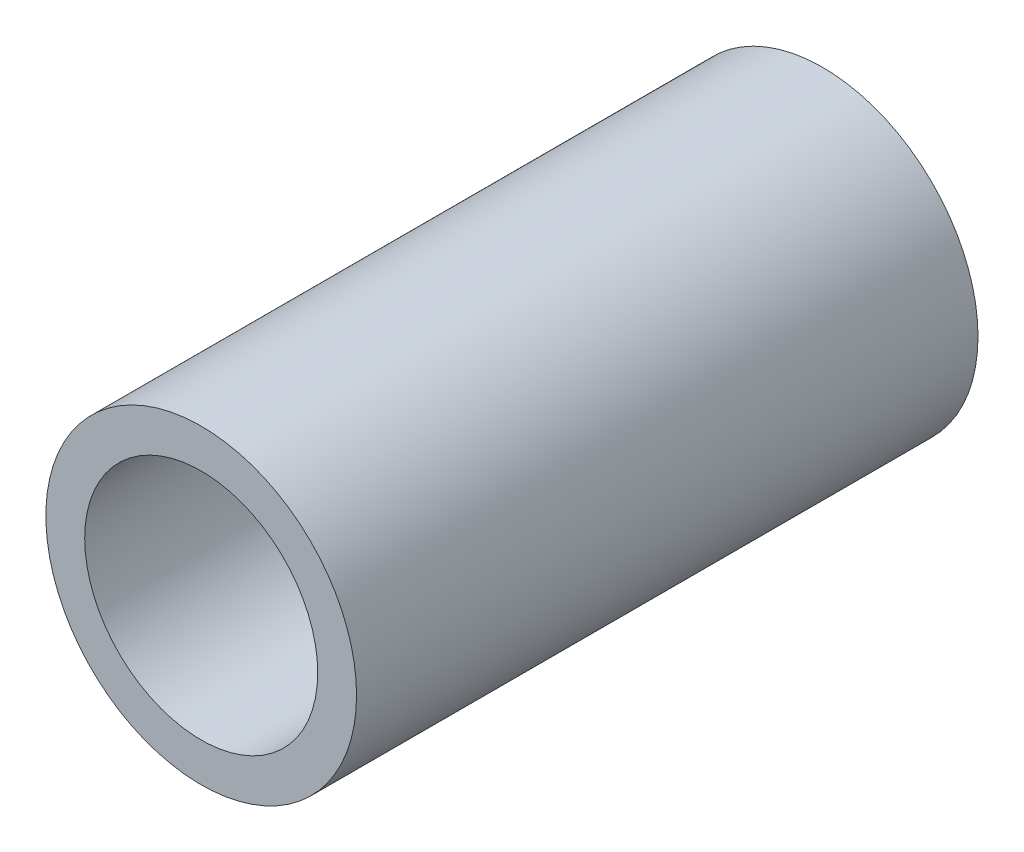
ISO-10303-21;
HEADER;
FILE_DESCRIPTION(('STEP AP214'),'2;1');
FILE_NAME('part.step','',(''),(''),'','','');
FILE_SCHEMA(('AUTOMOTIVE_DESIGN { 1 0 10303 214 1 1 1 1 }'));
ENDSEC;
DATA;
#1=APPLICATION_CONTEXT('core data for automotive mechanical design processes');
#2=APPLICATION_PROTOCOL_DEFINITION('international standard','automotive_design',2000,#1);
#3=PRODUCT_CONTEXT('',#1,'mechanical');
#4=PRODUCT('Part','Part','',(#3));
#5=PRODUCT_RELATED_PRODUCT_CATEGORY('part','',(#4));
#6=PRODUCT_DEFINITION_FORMATION('','',#4);
#7=PRODUCT_DEFINITION_CONTEXT('part definition',#1,'design');
#8=PRODUCT_DEFINITION('design','',#6,#7);
#9=PRODUCT_DEFINITION_SHAPE('','',#8);
#10=(LENGTH_UNIT() NAMED_UNIT(*) SI_UNIT(.MILLI.,.METRE.));
#11=(NAMED_UNIT(*) PLANE_ANGLE_UNIT() SI_UNIT($,.RADIAN.));
#12=(NAMED_UNIT(*) SI_UNIT($,.STERADIAN.) SOLID_ANGLE_UNIT());
#13=UNCERTAINTY_MEASURE_WITH_UNIT(LENGTH_MEASURE(1.E-05),#10,'distance_accuracy_value','');
#14=(GEOMETRIC_REPRESENTATION_CONTEXT(3) GLOBAL_UNCERTAINTY_ASSIGNED_CONTEXT((#13)) GLOBAL_UNIT_ASSIGNED_CONTEXT((#10,
#11,#12)) REPRESENTATION_CONTEXT('',''));
#15=CARTESIAN_POINT('',(0.,0.,0.));
#16=DIRECTION('',(0.,0.,1.));
#17=DIRECTION('',(1.,0.,0.));
#18=AXIS2_PLACEMENT_3D('',#15,#16,#17);
#19=CARTESIAN_POINT('',(0.,0.,16.));
#20=DIRECTION('',(0.,0.,1.));
#21=DIRECTION('',(1.,0.,0.));
#22=AXIS2_PLACEMENT_3D('',#19,#20,#21);
#23=PLANE('',#22);
#24=CARTESIAN_POINT('',(0.,0.,16.));
#25=DIRECTION('',(0.,0.,1.));
#26=DIRECTION('',(1.,0.,0.));
#27=AXIS2_PLACEMENT_3D('',#24,#25,#26);
#28=CIRCLE('',#27,4.);
#29=CARTESIAN_POINT('',(4.,0.,16.));
#30=VERTEX_POINT('',#29);
#31=EDGE_CURVE('E10',#30,#30,#28,.T.);
#32=ORIENTED_EDGE('',*,*,#31,.T.);
#33=EDGE_LOOP('',(#32));
#34=FACE_BOUND('',#33,.T.);
#35=CARTESIAN_POINT('',(0.,0.,16.));
#36=DIRECTION('',(0.,0.,1.));
#37=DIRECTION('',(1.,0.,0.));
#38=AXIS2_PLACEMENT_3D('',#35,#36,#37);
#39=CIRCLE('',#38,3.);
#40=CARTESIAN_POINT('',(3.,0.,16.));
#41=VERTEX_POINT('',#40);
#42=EDGE_CURVE('E44',#41,#41,#39,.T.);
#43=ORIENTED_EDGE('',*,*,#42,.F.);
#44=EDGE_LOOP('',(#43));
#45=FACE_BOUND('',#44,.T.);
#46=ADVANCED_FACE('F33',(#34,#45),#23,.T.);
#47=CARTESIAN_POINT('',(0.,0.,0.));
#48=DIRECTION('',(0.,0.,1.));
#49=DIRECTION('',(1.,0.,0.));
#50=AXIS2_PLACEMENT_3D('',#47,#48,#49);
#51=PLANE('',#50);
#52=CARTESIAN_POINT('',(0.,0.,0.));
#53=DIRECTION('',(0.,0.,1.));
#54=DIRECTION('',(1.,0.,0.));
#55=AXIS2_PLACEMENT_3D('',#52,#53,#54);
#56=CIRCLE('',#55,4.);
#57=CARTESIAN_POINT('',(4.,0.,0.));
#58=VERTEX_POINT('',#57);
#59=EDGE_CURVE('E37',#58,#58,#56,.T.);
#60=ORIENTED_EDGE('',*,*,#59,.F.);
#61=EDGE_LOOP('',(#60));
#62=FACE_BOUND('',#61,.T.);
#63=CARTESIAN_POINT('',(0.,0.,0.));
#64=DIRECTION('',(0.,0.,1.));
#65=DIRECTION('',(1.,0.,0.));
#66=AXIS2_PLACEMENT_3D('',#63,#64,#65);
#67=CIRCLE('',#66,3.);
#68=CARTESIAN_POINT('',(3.,0.,0.));
#69=VERTEX_POINT('',#68);
#70=EDGE_CURVE('E46',#69,#69,#67,.T.);
#71=ORIENTED_EDGE('',*,*,#70,.T.);
#72=EDGE_LOOP('',(#71));
#73=FACE_BOUND('',#72,.T.);
#74=ADVANCED_FACE('F56',(#62,#73),#51,.F.);
#75=CARTESIAN_POINT('',(0.,0.,16.));
#76=DIRECTION('',(0.,0.,-1.));
#77=DIRECTION('',(-1.,0.,0.));
#78=AXIS2_PLACEMENT_3D('',#75,#76,#77);
#79=CYLINDRICAL_SURFACE('',#78,4.);
#80=ORIENTED_EDGE('',*,*,#31,.F.);
#81=EDGE_LOOP('',(#80));
#82=FACE_BOUND('',#81,.T.);
#83=ORIENTED_EDGE('',*,*,#59,.T.);
#84=EDGE_LOOP('',(#83));
#85=FACE_BOUND('',#84,.T.);
#86=ADVANCED_FACE('F35',(#82,#85),#79,.T.);
#87=CARTESIAN_POINT('',(0.,0.,16.));
#88=DIRECTION('',(0.,0.,-1.));
#89=DIRECTION('',(-1.,0.,0.));
#90=AXIS2_PLACEMENT_3D('',#87,#88,#89);
#91=CYLINDRICAL_SURFACE('',#90,3.);
#92=ORIENTED_EDGE('',*,*,#42,.T.);
#93=EDGE_LOOP('',(#92));
#94=FACE_BOUND('',#93,.T.);
#95=ORIENTED_EDGE('',*,*,#70,.F.);
#96=EDGE_LOOP('',(#95));
#97=FACE_BOUND('',#96,.T.);
#98=ADVANCED_FACE('F52',(#94,#97),#91,.F.);
#99=CLOSED_SHELL('',(#46,#74,#86,#98));
#100=MANIFOLD_SOLID_BREP('B2',#99);
#101=ADVANCED_BREP_SHAPE_REPRESENTATION('',(#18,#100),#14);
#102=SHAPE_DEFINITION_REPRESENTATION(#9,#101);
ENDSEC;
END-ISO-10303-21;
